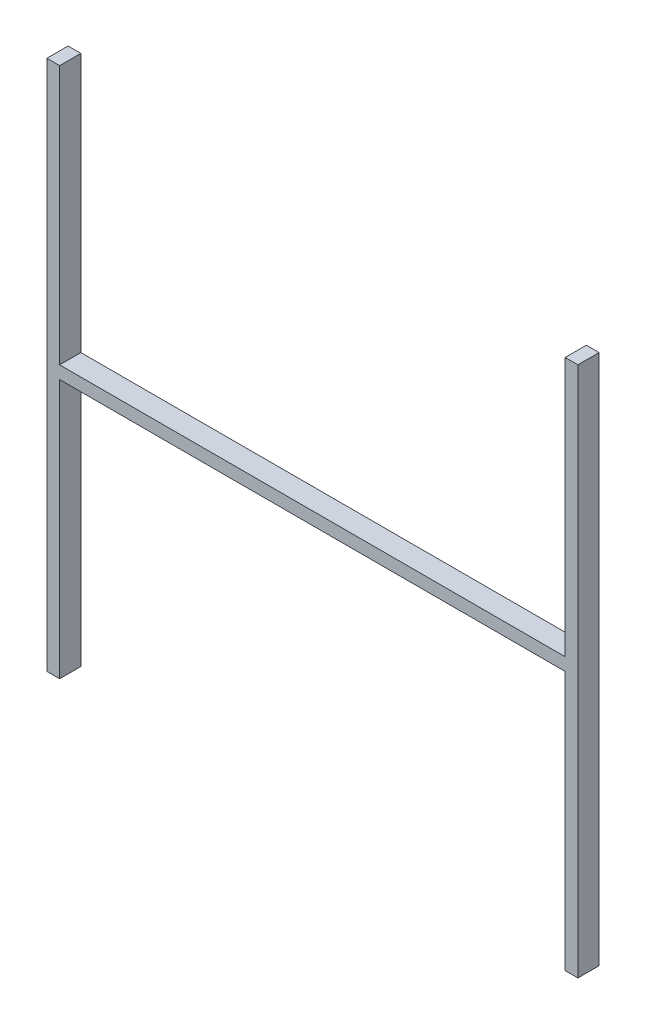
ISO-10303-21;
HEADER;
FILE_DESCRIPTION(('STEP AP214'),'2;1');
FILE_NAME('part.step','',(''),(''),'','','');
FILE_SCHEMA(('AUTOMOTIVE_DESIGN { 1 0 10303 214 1 1 1 1 }'));
ENDSEC;
DATA;
#1=APPLICATION_CONTEXT('core data for automotive mechanical design processes');
#2=APPLICATION_PROTOCOL_DEFINITION('international standard','automotive_design',2000,#1);
#3=PRODUCT_CONTEXT('',#1,'mechanical');
#4=PRODUCT('Part','Part','',(#3));
#5=PRODUCT_RELATED_PRODUCT_CATEGORY('part','',(#4));
#6=PRODUCT_DEFINITION_FORMATION('','',#4);
#7=PRODUCT_DEFINITION_CONTEXT('part definition',#1,'design');
#8=PRODUCT_DEFINITION('design','',#6,#7);
#9=PRODUCT_DEFINITION_SHAPE('','',#8);
#10=(LENGTH_UNIT() NAMED_UNIT(*) SI_UNIT(.MILLI.,.METRE.));
#11=(NAMED_UNIT(*) PLANE_ANGLE_UNIT() SI_UNIT($,.RADIAN.));
#12=(NAMED_UNIT(*) SI_UNIT($,.STERADIAN.) SOLID_ANGLE_UNIT());
#13=UNCERTAINTY_MEASURE_WITH_UNIT(LENGTH_MEASURE(1.E-05),#10,'distance_accuracy_value','');
#14=(GEOMETRIC_REPRESENTATION_CONTEXT(3) GLOBAL_UNCERTAINTY_ASSIGNED_CONTEXT((#13)) GLOBAL_UNIT_ASSIGNED_CONTEXT((#10,
#11,#12)) REPRESENTATION_CONTEXT('',''));
#15=CARTESIAN_POINT('',(0.,0.,0.));
#16=DIRECTION('',(0.,0.,1.));
#17=DIRECTION('',(1.,0.,0.));
#18=AXIS2_PLACEMENT_3D('',#15,#16,#17);
#19=CARTESIAN_POINT('',(-125.,125.,10.));
#20=DIRECTION('',(0.,-1.,0.));
#21=DIRECTION('',(0.,0.,-1.));
#22=AXIS2_PLACEMENT_3D('',#19,#20,#21);
#23=PLANE('',#22);
#24=DIRECTION('',(-1.,0.,0.));
#25=VECTOR('',#24,1.);
#26=CARTESIAN_POINT('',(-125.,125.,0.));
#27=LINE('',#26,#25);
#28=CARTESIAN_POINT('',(-119.,125.,0.));
#29=VERTEX_POINT('',#28);
#30=CARTESIAN_POINT('',(-125.,125.,0.));
#31=VERTEX_POINT('',#30);
#32=EDGE_CURVE('E153',#29,#31,#27,.T.);
#33=ORIENTED_EDGE('',*,*,#32,.T.);
#34=DIRECTION('',(0.,0.,-1.));
#35=VECTOR('',#34,1.);
#36=CARTESIAN_POINT('',(-125.,125.,10.));
#37=LINE('',#36,#35);
#38=CARTESIAN_POINT('',(-125.,125.,10.));
#39=VERTEX_POINT('',#38);
#40=EDGE_CURVE('E11',#39,#31,#37,.T.);
#41=ORIENTED_EDGE('',*,*,#40,.F.);
#42=DIRECTION('',(-1.,0.,0.));
#43=VECTOR('',#42,1.);
#44=CARTESIAN_POINT('',(-125.,125.,10.));
#45=LINE('',#44,#43);
#46=CARTESIAN_POINT('',(-119.,125.,10.));
#47=VERTEX_POINT('',#46);
#48=EDGE_CURVE('E175',#47,#39,#45,.T.);
#49=ORIENTED_EDGE('',*,*,#48,.F.);
#50=DIRECTION('',(0.,0.,-1.));
#51=VECTOR('',#50,1.);
#52=CARTESIAN_POINT('',(-119.,125.,10.));
#53=LINE('',#52,#51);
#54=EDGE_CURVE('E149',#47,#29,#53,.T.);
#55=ORIENTED_EDGE('',*,*,#54,.T.);
#56=EDGE_LOOP('',(#33,#41,#49,#55));
#57=FACE_BOUND('',#56,.T.);
#58=ADVANCED_FACE('F33',(#57),#23,.F.);
#59=CARTESIAN_POINT('',(-125.,125.,10.));
#60=DIRECTION('',(1.,0.,0.));
#61=DIRECTION('',(0.,0.,-1.));
#62=AXIS2_PLACEMENT_3D('',#59,#60,#61);
#63=PLANE('',#62);
#64=DIRECTION('',(0.,-1.,0.));
#65=VECTOR('',#64,1.);
#66=CARTESIAN_POINT('',(-125.,125.,0.));
#67=LINE('',#66,#65);
#68=CARTESIAN_POINT('',(-125.,-125.,0.));
#69=VERTEX_POINT('',#68);
#70=EDGE_CURVE('E156',#31,#69,#67,.T.);
#71=ORIENTED_EDGE('',*,*,#70,.T.);
#72=DIRECTION('',(0.,0.,-1.));
#73=VECTOR('',#72,1.);
#74=CARTESIAN_POINT('',(-125.,-125.,10.));
#75=LINE('',#74,#73);
#76=CARTESIAN_POINT('',(-125.,-125.,10.));
#77=VERTEX_POINT('',#76);
#78=EDGE_CURVE('E41',#77,#69,#75,.T.);
#79=ORIENTED_EDGE('',*,*,#78,.F.);
#80=DIRECTION('',(0.,-1.,0.));
#81=VECTOR('',#80,1.);
#82=CARTESIAN_POINT('',(-125.,125.,10.));
#83=LINE('',#82,#81);
#84=EDGE_CURVE('E104',#39,#77,#83,.T.);
#85=ORIENTED_EDGE('',*,*,#84,.F.);
#86=ORIENTED_EDGE('',*,*,#40,.T.);
#87=EDGE_LOOP('',(#71,#79,#85,#86));
#88=FACE_BOUND('',#87,.T.);
#89=ADVANCED_FACE('F253',(#88),#63,.F.);
#90=CARTESIAN_POINT('',(-125.,-125.,10.));
#91=DIRECTION('',(0.,1.,0.));
#92=DIRECTION('',(0.,0.,1.));
#93=AXIS2_PLACEMENT_3D('',#90,#91,#92);
#94=PLANE('',#93);
#95=DIRECTION('',(1.,0.,0.));
#96=VECTOR('',#95,1.);
#97=CARTESIAN_POINT('',(-125.,-125.,0.));
#98=LINE('',#97,#96);
#99=CARTESIAN_POINT('',(-119.,-125.,0.));
#100=VERTEX_POINT('',#99);
#101=EDGE_CURVE('E158',#69,#100,#98,.T.);
#102=ORIENTED_EDGE('',*,*,#101,.T.);
#103=DIRECTION('',(0.,0.,-1.));
#104=VECTOR('',#103,1.);
#105=CARTESIAN_POINT('',(-119.,-125.,10.));
#106=LINE('',#105,#104);
#107=CARTESIAN_POINT('',(-119.,-125.,10.));
#108=VERTEX_POINT('',#107);
#109=EDGE_CURVE('E194',#108,#100,#106,.T.);
#110=ORIENTED_EDGE('',*,*,#109,.F.);
#111=DIRECTION('',(1.,0.,0.));
#112=VECTOR('',#111,1.);
#113=CARTESIAN_POINT('',(-125.,-125.,10.));
#114=LINE('',#113,#112);
#115=EDGE_CURVE('E202',#77,#108,#114,.T.);
#116=ORIENTED_EDGE('',*,*,#115,.F.);
#117=ORIENTED_EDGE('',*,*,#78,.T.);
#118=EDGE_LOOP('',(#102,#110,#116,#117));
#119=FACE_BOUND('',#118,.T.);
#120=ADVANCED_FACE('F200',(#119),#94,.F.);
#121=CARTESIAN_POINT('',(-119.,-3.,10.));
#122=DIRECTION('',(-1.,0.,0.));
#123=DIRECTION('',(0.,-1.,0.));
#124=AXIS2_PLACEMENT_3D('',#121,#122,#123);
#125=PLANE('',#124);
#126=DIRECTION('',(0.,1.,0.));
#127=VECTOR('',#126,1.);
#128=CARTESIAN_POINT('',(-119.,-3.,0.));
#129=LINE('',#128,#127);
#130=CARTESIAN_POINT('',(-119.,-3.,0.));
#131=VERTEX_POINT('',#130);
#132=EDGE_CURVE('E160',#100,#131,#129,.T.);
#133=ORIENTED_EDGE('',*,*,#132,.T.);
#134=DIRECTION('',(0.,0.,-1.));
#135=VECTOR('',#134,1.);
#136=CARTESIAN_POINT('',(-119.,-3.,10.));
#137=LINE('',#136,#135);
#138=CARTESIAN_POINT('',(-119.,-3.,10.));
#139=VERTEX_POINT('',#138);
#140=EDGE_CURVE('E191',#139,#131,#137,.T.);
#141=ORIENTED_EDGE('',*,*,#140,.F.);
#142=DIRECTION('',(0.,1.,0.));
#143=VECTOR('',#142,1.);
#144=CARTESIAN_POINT('',(-119.,-3.,10.));
#145=LINE('',#144,#143);
#146=EDGE_CURVE('E220',#108,#139,#145,.T.);
#147=ORIENTED_EDGE('',*,*,#146,.F.);
#148=ORIENTED_EDGE('',*,*,#109,.T.);
#149=EDGE_LOOP('',(#133,#141,#147,#148));
#150=FACE_BOUND('',#149,.T.);
#151=ADVANCED_FACE('F211',(#150),#125,.F.);
#152=CARTESIAN_POINT('',(-119.,-3.,10.));
#153=DIRECTION('',(0.,1.,0.));
#154=DIRECTION('',(0.,0.,1.));
#155=AXIS2_PLACEMENT_3D('',#152,#153,#154);
#156=PLANE('',#155);
#157=DIRECTION('',(1.,0.,0.));
#158=VECTOR('',#157,1.);
#159=CARTESIAN_POINT('',(-119.,-3.,0.));
#160=LINE('',#159,#158);
#161=CARTESIAN_POINT('',(119.,-3.,0.));
#162=VERTEX_POINT('',#161);
#163=EDGE_CURVE('E162',#131,#162,#160,.T.);
#164=ORIENTED_EDGE('',*,*,#163,.T.);
#165=DIRECTION('',(0.,0.,-1.));
#166=VECTOR('',#165,1.);
#167=CARTESIAN_POINT('',(119.,-3.,10.));
#168=LINE('',#167,#166);
#169=CARTESIAN_POINT('',(119.,-3.,10.));
#170=VERTEX_POINT('',#169);
#171=EDGE_CURVE('E188',#170,#162,#168,.T.);
#172=ORIENTED_EDGE('',*,*,#171,.F.);
#173=DIRECTION('',(1.,0.,0.));
#174=VECTOR('',#173,1.);
#175=CARTESIAN_POINT('',(-119.,-3.,10.));
#176=LINE('',#175,#174);
#177=EDGE_CURVE('E217',#139,#170,#176,.T.);
#178=ORIENTED_EDGE('',*,*,#177,.F.);
#179=ORIENTED_EDGE('',*,*,#140,.T.);
#180=EDGE_LOOP('',(#164,#172,#178,#179));
#181=FACE_BOUND('',#180,.T.);
#182=ADVANCED_FACE('F215',(#181),#156,.F.);
#183=CARTESIAN_POINT('',(119.,-3.,10.));
#184=DIRECTION('',(1.,0.,0.));
#185=DIRECTION('',(0.,1.,0.));
#186=AXIS2_PLACEMENT_3D('',#183,#184,#185);
#187=PLANE('',#186);
#188=DIRECTION('',(0.,-1.,0.));
#189=VECTOR('',#188,1.);
#190=CARTESIAN_POINT('',(119.,-3.,0.));
#191=LINE('',#190,#189);
#192=CARTESIAN_POINT('',(119.,-125.,0.));
#193=VERTEX_POINT('',#192);
#194=EDGE_CURVE('E164',#162,#193,#191,.T.);
#195=ORIENTED_EDGE('',*,*,#194,.T.);
#196=DIRECTION('',(0.,0.,-1.));
#197=VECTOR('',#196,1.);
#198=CARTESIAN_POINT('',(119.,-125.,10.));
#199=LINE('',#198,#197);
#200=CARTESIAN_POINT('',(119.,-125.,10.));
#201=VERTEX_POINT('',#200);
#202=EDGE_CURVE('E185',#201,#193,#199,.T.);
#203=ORIENTED_EDGE('',*,*,#202,.F.);
#204=DIRECTION('',(0.,-1.,0.));
#205=VECTOR('',#204,1.);
#206=CARTESIAN_POINT('',(119.,-3.,10.));
#207=LINE('',#206,#205);
#208=EDGE_CURVE('E219',#170,#201,#207,.T.);
#209=ORIENTED_EDGE('',*,*,#208,.F.);
#210=ORIENTED_EDGE('',*,*,#171,.T.);
#211=EDGE_LOOP('',(#195,#203,#209,#210));
#212=FACE_BOUND('',#211,.T.);
#213=ADVANCED_FACE('F266',(#212),#187,.F.);
#214=CARTESIAN_POINT('',(119.,-125.,10.));
#215=DIRECTION('',(0.,1.,0.));
#216=DIRECTION('',(0.,0.,1.));
#217=AXIS2_PLACEMENT_3D('',#214,#215,#216);
#218=PLANE('',#217);
#219=DIRECTION('',(1.,0.,0.));
#220=VECTOR('',#219,1.);
#221=CARTESIAN_POINT('',(119.,-125.,0.));
#222=LINE('',#221,#220);
#223=CARTESIAN_POINT('',(125.,-125.,0.));
#224=VERTEX_POINT('',#223);
#225=EDGE_CURVE('E166',#193,#224,#222,.T.);
#226=ORIENTED_EDGE('',*,*,#225,.T.);
#227=DIRECTION('',(0.,0.,-1.));
#228=VECTOR('',#227,1.);
#229=CARTESIAN_POINT('',(125.,-125.,10.));
#230=LINE('',#229,#228);
#231=CARTESIAN_POINT('',(125.,-125.,10.));
#232=VERTEX_POINT('',#231);
#233=EDGE_CURVE('E182',#232,#224,#230,.T.);
#234=ORIENTED_EDGE('',*,*,#233,.F.);
#235=DIRECTION('',(1.,0.,0.));
#236=VECTOR('',#235,1.);
#237=CARTESIAN_POINT('',(119.,-125.,10.));
#238=LINE('',#237,#236);
#239=EDGE_CURVE('E222',#201,#232,#238,.T.);
#240=ORIENTED_EDGE('',*,*,#239,.F.);
#241=ORIENTED_EDGE('',*,*,#202,.T.);
#242=EDGE_LOOP('',(#226,#234,#240,#241));
#243=FACE_BOUND('',#242,.T.);
#244=ADVANCED_FACE('F269',(#243),#218,.F.);
#245=CARTESIAN_POINT('',(125.,125.,10.));
#246=DIRECTION('',(-1.,0.,0.));
#247=DIRECTION('',(0.,0.,1.));
#248=AXIS2_PLACEMENT_3D('',#245,#246,#247);
#249=PLANE('',#248);
#250=DIRECTION('',(0.,1.,0.));
#251=VECTOR('',#250,1.);
#252=CARTESIAN_POINT('',(125.,125.,0.));
#253=LINE('',#252,#251);
#254=CARTESIAN_POINT('',(125.,125.,0.));
#255=VERTEX_POINT('',#254);
#256=EDGE_CURVE('E168',#224,#255,#253,.T.);
#257=ORIENTED_EDGE('',*,*,#256,.T.);
#258=DIRECTION('',(0.,0.,-1.));
#259=VECTOR('',#258,1.);
#260=CARTESIAN_POINT('',(125.,125.,10.));
#261=LINE('',#260,#259);
#262=CARTESIAN_POINT('',(125.,125.,10.));
#263=VERTEX_POINT('',#262);
#264=EDGE_CURVE('E179',#263,#255,#261,.T.);
#265=ORIENTED_EDGE('',*,*,#264,.F.);
#266=DIRECTION('',(0.,1.,0.));
#267=VECTOR('',#266,1.);
#268=CARTESIAN_POINT('',(125.,125.,10.));
#269=LINE('',#268,#267);
#270=EDGE_CURVE('E228',#232,#263,#269,.T.);
#271=ORIENTED_EDGE('',*,*,#270,.F.);
#272=ORIENTED_EDGE('',*,*,#233,.T.);
#273=EDGE_LOOP('',(#257,#265,#271,#272));
#274=FACE_BOUND('',#273,.T.);
#275=ADVANCED_FACE('F234',(#274),#249,.F.);
#276=CARTESIAN_POINT('',(119.,125.,10.));
#277=DIRECTION('',(0.,-1.,0.));
#278=DIRECTION('',(0.,0.,-1.));
#279=AXIS2_PLACEMENT_3D('',#276,#277,#278);
#280=PLANE('',#279);
#281=DIRECTION('',(-1.,0.,0.));
#282=VECTOR('',#281,1.);
#283=CARTESIAN_POINT('',(119.,125.,0.));
#284=LINE('',#283,#282);
#285=CARTESIAN_POINT('',(119.,125.,0.));
#286=VERTEX_POINT('',#285);
#287=EDGE_CURVE('E170',#255,#286,#284,.T.);
#288=ORIENTED_EDGE('',*,*,#287,.T.);
#289=DIRECTION('',(0.,0.,-1.));
#290=VECTOR('',#289,1.);
#291=CARTESIAN_POINT('',(119.,125.,10.));
#292=LINE('',#291,#290);
#293=CARTESIAN_POINT('',(119.,125.,10.));
#294=VERTEX_POINT('',#293);
#295=EDGE_CURVE('E144',#294,#286,#292,.T.);
#296=ORIENTED_EDGE('',*,*,#295,.F.);
#297=DIRECTION('',(-1.,0.,0.));
#298=VECTOR('',#297,1.);
#299=CARTESIAN_POINT('',(119.,125.,10.));
#300=LINE('',#299,#298);
#301=EDGE_CURVE('E135',#263,#294,#300,.T.);
#302=ORIENTED_EDGE('',*,*,#301,.F.);
#303=ORIENTED_EDGE('',*,*,#264,.T.);
#304=EDGE_LOOP('',(#288,#296,#302,#303));
#305=FACE_BOUND('',#304,.T.);
#306=ADVANCED_FACE('F238',(#305),#280,.F.);
#307=CARTESIAN_POINT('',(119.,125.,10.));
#308=DIRECTION('',(1.,0.,0.));
#309=DIRECTION('',(0.,1.,0.));
#310=AXIS2_PLACEMENT_3D('',#307,#308,#309);
#311=PLANE('',#310);
#312=DIRECTION('',(0.,-1.,0.));
#313=VECTOR('',#312,1.);
#314=CARTESIAN_POINT('',(119.,125.,0.));
#315=LINE('',#314,#313);
#316=CARTESIAN_POINT('',(119.,3.,0.));
#317=VERTEX_POINT('',#316);
#318=EDGE_CURVE('E143',#286,#317,#315,.T.);
#319=ORIENTED_EDGE('',*,*,#318,.T.);
#320=DIRECTION('',(0.,0.,-1.));
#321=VECTOR('',#320,1.);
#322=CARTESIAN_POINT('',(119.,3.,10.));
#323=LINE('',#322,#321);
#324=CARTESIAN_POINT('',(119.,3.,10.));
#325=VERTEX_POINT('',#324);
#326=EDGE_CURVE('E140',#325,#317,#323,.T.);
#327=ORIENTED_EDGE('',*,*,#326,.F.);
#328=DIRECTION('',(0.,-1.,0.));
#329=VECTOR('',#328,1.);
#330=CARTESIAN_POINT('',(119.,125.,10.));
#331=LINE('',#330,#329);
#332=EDGE_CURVE('E129',#294,#325,#331,.T.);
#333=ORIENTED_EDGE('',*,*,#332,.F.);
#334=ORIENTED_EDGE('',*,*,#295,.T.);
#335=EDGE_LOOP('',(#319,#327,#333,#334));
#336=FACE_BOUND('',#335,.T.);
#337=ADVANCED_FACE('F141',(#336),#311,.F.);
#338=CARTESIAN_POINT('',(-119.,3.,10.));
#339=DIRECTION('',(0.,-1.,0.));
#340=DIRECTION('',(0.,0.,-1.));
#341=AXIS2_PLACEMENT_3D('',#338,#339,#340);
#342=PLANE('',#341);
#343=DIRECTION('',(-1.,0.,0.));
#344=VECTOR('',#343,1.);
#345=CARTESIAN_POINT('',(-119.,3.,0.));
#346=LINE('',#345,#344);
#347=CARTESIAN_POINT('',(-119.,3.,0.));
#348=VERTEX_POINT('',#347);
#349=EDGE_CURVE('E90',#317,#348,#346,.T.);
#350=ORIENTED_EDGE('',*,*,#349,.T.);
#351=DIRECTION('',(0.,0.,-1.));
#352=VECTOR('',#351,1.);
#353=CARTESIAN_POINT('',(-119.,3.,10.));
#354=LINE('',#353,#352);
#355=CARTESIAN_POINT('',(-119.,3.,10.));
#356=VERTEX_POINT('',#355);
#357=EDGE_CURVE('E145',#356,#348,#354,.T.);
#358=ORIENTED_EDGE('',*,*,#357,.F.);
#359=DIRECTION('',(-1.,0.,0.));
#360=VECTOR('',#359,1.);
#361=CARTESIAN_POINT('',(-119.,3.,10.));
#362=LINE('',#361,#360);
#363=EDGE_CURVE('E133',#325,#356,#362,.T.);
#364=ORIENTED_EDGE('',*,*,#363,.F.);
#365=ORIENTED_EDGE('',*,*,#326,.T.);
#366=EDGE_LOOP('',(#350,#358,#364,#365));
#367=FACE_BOUND('',#366,.T.);
#368=ADVANCED_FACE('F147',(#367),#342,.F.);
#369=CARTESIAN_POINT('',(-119.,125.,10.));
#370=DIRECTION('',(-1.,0.,0.));
#371=DIRECTION('',(0.,-1.,0.));
#372=AXIS2_PLACEMENT_3D('',#369,#370,#371);
#373=PLANE('',#372);
#374=DIRECTION('',(0.,1.,0.));
#375=VECTOR('',#374,1.);
#376=CARTESIAN_POINT('',(-119.,125.,0.));
#377=LINE('',#376,#375);
#378=EDGE_CURVE('E96',#348,#29,#377,.T.);
#379=ORIENTED_EDGE('',*,*,#378,.T.);
#380=ORIENTED_EDGE('',*,*,#54,.F.);
#381=DIRECTION('',(0.,1.,0.));
#382=VECTOR('',#381,1.);
#383=CARTESIAN_POINT('',(-119.,125.,10.));
#384=LINE('',#383,#382);
#385=EDGE_CURVE('E49',#356,#47,#384,.T.);
#386=ORIENTED_EDGE('',*,*,#385,.F.);
#387=ORIENTED_EDGE('',*,*,#357,.T.);
#388=EDGE_LOOP('',(#379,#380,#386,#387));
#389=FACE_BOUND('',#388,.T.);
#390=ADVANCED_FACE('F242',(#389),#373,.F.);
#391=CARTESIAN_POINT('',(0.,0.,10.));
#392=DIRECTION('',(0.,0.,-1.));
#393=DIRECTION('',(-1.,0.,0.));
#394=AXIS2_PLACEMENT_3D('',#391,#392,#393);
#395=PLANE('',#394);
#396=ORIENTED_EDGE('',*,*,#48,.T.);
#397=ORIENTED_EDGE('',*,*,#84,.T.);
#398=ORIENTED_EDGE('',*,*,#115,.T.);
#399=ORIENTED_EDGE('',*,*,#146,.T.);
#400=ORIENTED_EDGE('',*,*,#177,.T.);
#401=ORIENTED_EDGE('',*,*,#208,.T.);
#402=ORIENTED_EDGE('',*,*,#239,.T.);
#403=ORIENTED_EDGE('',*,*,#270,.T.);
#404=ORIENTED_EDGE('',*,*,#301,.T.);
#405=ORIENTED_EDGE('',*,*,#332,.T.);
#406=ORIENTED_EDGE('',*,*,#363,.T.);
#407=ORIENTED_EDGE('',*,*,#385,.T.);
#408=EDGE_LOOP('',(#396,#397,#398,#399,#400,#401,#402,#403,#404,#405,#406,#407));
#409=FACE_BOUND('',#408,.T.);
#410=ADVANCED_FACE('F131',(#409),#395,.F.);
#411=CARTESIAN_POINT('',(0.,0.,0.));
#412=DIRECTION('',(0.,0.,-1.));
#413=DIRECTION('',(-1.,0.,0.));
#414=AXIS2_PLACEMENT_3D('',#411,#412,#413);
#415=PLANE('',#414);
#416=ORIENTED_EDGE('',*,*,#32,.F.);
#417=ORIENTED_EDGE('',*,*,#378,.F.);
#418=ORIENTED_EDGE('',*,*,#349,.F.);
#419=ORIENTED_EDGE('',*,*,#318,.F.);
#420=ORIENTED_EDGE('',*,*,#287,.F.);
#421=ORIENTED_EDGE('',*,*,#256,.F.);
#422=ORIENTED_EDGE('',*,*,#225,.F.);
#423=ORIENTED_EDGE('',*,*,#194,.F.);
#424=ORIENTED_EDGE('',*,*,#163,.F.);
#425=ORIENTED_EDGE('',*,*,#132,.F.);
#426=ORIENTED_EDGE('',*,*,#101,.F.);
#427=ORIENTED_EDGE('',*,*,#70,.F.);
#428=EDGE_LOOP('',(#416,#417,#418,#419,#420,#421,#422,#423,#424,#425,#426,#427));
#429=FACE_BOUND('',#428,.T.);
#430=ADVANCED_FACE('F206',(#429),#415,.T.);
#431=CLOSED_SHELL('',(#58,#89,#120,#151,#182,#213,#244,#275,#306,#337,#368,#390,#410,#430));
#432=MANIFOLD_SOLID_BREP('B2',#431);
#433=ADVANCED_BREP_SHAPE_REPRESENTATION('',(#18,#432),#14);
#434=SHAPE_DEFINITION_REPRESENTATION(#9,#433);
ENDSEC;
END-ISO-10303-21;
